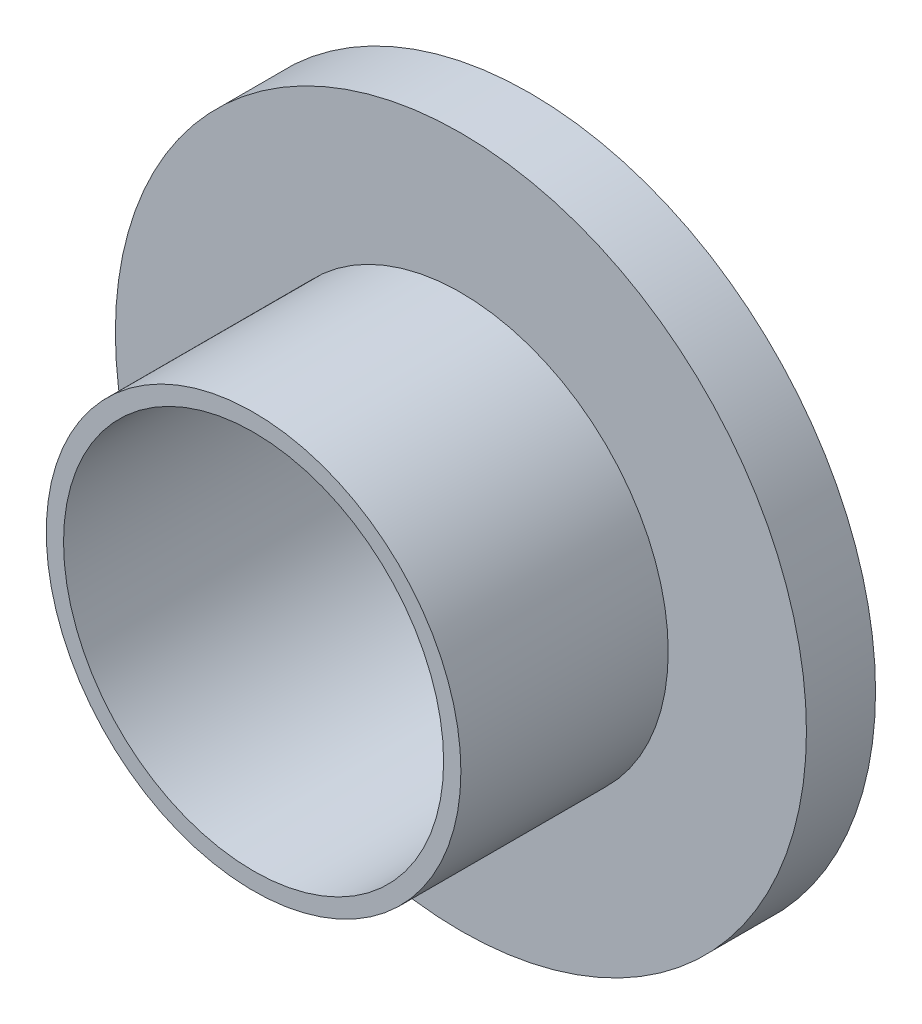
ISO-10303-21;
HEADER;
FILE_DESCRIPTION(('STEP AP214'),'2;1');
FILE_NAME('part.step','',(''),(''),'','','');
FILE_SCHEMA(('AUTOMOTIVE_DESIGN { 1 0 10303 214 1 1 1 1 }'));
ENDSEC;
DATA;
#1=APPLICATION_CONTEXT('core data for automotive mechanical design processes');
#2=APPLICATION_PROTOCOL_DEFINITION('international standard','automotive_design',2000,#1);
#3=PRODUCT_CONTEXT('',#1,'mechanical');
#4=PRODUCT('Part','Part','',(#3));
#5=PRODUCT_RELATED_PRODUCT_CATEGORY('part','',(#4));
#6=PRODUCT_DEFINITION_FORMATION('','',#4);
#7=PRODUCT_DEFINITION_CONTEXT('part definition',#1,'design');
#8=PRODUCT_DEFINITION('design','',#6,#7);
#9=PRODUCT_DEFINITION_SHAPE('','',#8);
#10=(LENGTH_UNIT() NAMED_UNIT(*) SI_UNIT(.MILLI.,.METRE.));
#11=(NAMED_UNIT(*) PLANE_ANGLE_UNIT() SI_UNIT($,.RADIAN.));
#12=(NAMED_UNIT(*) SI_UNIT($,.STERADIAN.) SOLID_ANGLE_UNIT());
#13=UNCERTAINTY_MEASURE_WITH_UNIT(LENGTH_MEASURE(1.E-05),#10,'distance_accuracy_value','');
#14=(GEOMETRIC_REPRESENTATION_CONTEXT(3) GLOBAL_UNCERTAINTY_ASSIGNED_CONTEXT((#13)) GLOBAL_UNIT_ASSIGNED_CONTEXT((#10,
#11,#12)) REPRESENTATION_CONTEXT('',''));
#15=CARTESIAN_POINT('',(0.,0.,0.));
#16=DIRECTION('',(0.,0.,1.));
#17=DIRECTION('',(1.,0.,0.));
#18=AXIS2_PLACEMENT_3D('',#15,#16,#17);
#19=CARTESIAN_POINT('',(0.,0.,16.));
#20=DIRECTION('',(0.,0.,-1.));
#21=DIRECTION('',(-1.,0.,0.));
#22=AXIS2_PLACEMENT_3D('',#19,#20,#21);
#23=CYLINDRICAL_SURFACE('',#22,20.);
#24=CARTESIAN_POINT('',(0.,0.,0.));
#25=DIRECTION('',(0.,0.,1.));
#26=DIRECTION('',(1.,0.,0.));
#27=AXIS2_PLACEMENT_3D('',#24,#25,#26);
#28=CIRCLE('',#27,20.);
#29=CARTESIAN_POINT('',(20.,0.,0.));
#30=VERTEX_POINT('',#29);
#31=EDGE_CURVE('E10',#30,#30,#28,.T.);
#32=ORIENTED_EDGE('',*,*,#31,.T.);
#33=EDGE_LOOP('',(#32));
#34=FACE_BOUND('',#33,.T.);
#35=CARTESIAN_POINT('',(0.,0.,4.));
#36=DIRECTION('',(0.,0.,1.));
#37=DIRECTION('',(1.,0.,0.));
#38=AXIS2_PLACEMENT_3D('',#35,#36,#37);
#39=CIRCLE('',#38,20.);
#40=CARTESIAN_POINT('',(20.,0.,4.));
#41=VERTEX_POINT('',#40);
#42=EDGE_CURVE('E35',#41,#41,#39,.T.);
#43=ORIENTED_EDGE('',*,*,#42,.F.);
#44=EDGE_LOOP('',(#43));
#45=FACE_BOUND('',#44,.T.);
#46=ADVANCED_FACE('F29',(#34,#45),#23,.T.);
#47=CARTESIAN_POINT('',(0.,0.,0.));
#48=DIRECTION('',(0.,0.,1.));
#49=DIRECTION('',(1.,0.,0.));
#50=AXIS2_PLACEMENT_3D('',#47,#48,#49);
#51=PLANE('',#50);
#52=CARTESIAN_POINT('',(0.,0.,0.));
#53=DIRECTION('',(0.,0.,1.));
#54=DIRECTION('',(1.,0.,0.));
#55=AXIS2_PLACEMENT_3D('',#52,#53,#54);
#56=CIRCLE('',#55,11.);
#57=CARTESIAN_POINT('',(11.,0.,0.));
#58=VERTEX_POINT('',#57);
#59=EDGE_CURVE('E47',#58,#58,#56,.T.);
#60=ORIENTED_EDGE('',*,*,#59,.T.);
#61=EDGE_LOOP('',(#60));
#62=FACE_BOUND('',#61,.T.);
#63=ORIENTED_EDGE('',*,*,#31,.F.);
#64=EDGE_LOOP('',(#63));
#65=FACE_BOUND('',#64,.T.);
#66=ADVANCED_FACE('F55',(#62,#65),#51,.F.);
#67=CARTESIAN_POINT('',(0.,0.,4.));
#68=DIRECTION('',(0.,0.,1.));
#69=DIRECTION('',(1.,0.,0.));
#70=AXIS2_PLACEMENT_3D('',#67,#68,#69);
#71=PLANE('',#70);
#72=CARTESIAN_POINT('',(0.,0.,4.));
#73=DIRECTION('',(0.,0.,1.));
#74=DIRECTION('',(1.,0.,0.));
#75=AXIS2_PLACEMENT_3D('',#72,#73,#74);
#76=CIRCLE('',#75,12.);
#77=CARTESIAN_POINT('',(12.,0.,4.));
#78=VERTEX_POINT('',#77);
#79=EDGE_CURVE('E39',#78,#78,#76,.T.);
#80=ORIENTED_EDGE('',*,*,#79,.F.);
#81=EDGE_LOOP('',(#80));
#82=FACE_BOUND('',#81,.T.);
#83=ORIENTED_EDGE('',*,*,#42,.T.);
#84=EDGE_LOOP('',(#83));
#85=FACE_BOUND('',#84,.T.);
#86=ADVANCED_FACE('F72',(#82,#85),#71,.T.);
#87=CARTESIAN_POINT('',(0.,0.,4.));
#88=DIRECTION('',(0.,0.,1.));
#89=DIRECTION('',(1.,0.,0.));
#90=AXIS2_PLACEMENT_3D('',#87,#88,#89);
#91=CYLINDRICAL_SURFACE('',#90,12.);
#92=ORIENTED_EDGE('',*,*,#79,.T.);
#93=EDGE_LOOP('',(#92));
#94=FACE_BOUND('',#93,.T.);
#95=CARTESIAN_POINT('',(0.,0.,16.));
#96=DIRECTION('',(0.,0.,1.));
#97=DIRECTION('',(1.,0.,0.));
#98=AXIS2_PLACEMENT_3D('',#95,#96,#97);
#99=CIRCLE('',#98,12.);
#100=CARTESIAN_POINT('',(12.,0.,16.));
#101=VERTEX_POINT('',#100);
#102=EDGE_CURVE('E43',#101,#101,#99,.T.);
#103=ORIENTED_EDGE('',*,*,#102,.F.);
#104=EDGE_LOOP('',(#103));
#105=FACE_BOUND('',#104,.T.);
#106=ADVANCED_FACE('F67',(#94,#105),#91,.T.);
#107=CARTESIAN_POINT('',(0.,0.,16.));
#108=DIRECTION('',(0.,0.,1.));
#109=DIRECTION('',(1.,0.,0.));
#110=AXIS2_PLACEMENT_3D('',#107,#108,#109);
#111=PLANE('',#110);
#112=CARTESIAN_POINT('',(0.,0.,16.));
#113=DIRECTION('',(0.,0.,1.));
#114=DIRECTION('',(1.,0.,0.));
#115=AXIS2_PLACEMENT_3D('',#112,#113,#114);
#116=CIRCLE('',#115,11.);
#117=CARTESIAN_POINT('',(11.,0.,16.));
#118=VERTEX_POINT('',#117);
#119=EDGE_CURVE('E49',#118,#118,#116,.T.);
#120=ORIENTED_EDGE('',*,*,#119,.F.);
#121=EDGE_LOOP('',(#120));
#122=FACE_BOUND('',#121,.T.);
#123=ORIENTED_EDGE('',*,*,#102,.T.);
#124=EDGE_LOOP('',(#123));
#125=FACE_BOUND('',#124,.T.);
#126=ADVANCED_FACE('F61',(#122,#125),#111,.T.);
#127=CARTESIAN_POINT('',(0.,0.,0.));
#128=DIRECTION('',(0.,0.,1.));
#129=DIRECTION('',(1.,0.,0.));
#130=AXIS2_PLACEMENT_3D('',#127,#128,#129);
#131=CYLINDRICAL_SURFACE('',#130,11.);
#132=ORIENTED_EDGE('',*,*,#59,.F.);
#133=EDGE_LOOP('',(#132));
#134=FACE_BOUND('',#133,.T.);
#135=ORIENTED_EDGE('',*,*,#119,.T.);
#136=EDGE_LOOP('',(#135));
#137=FACE_BOUND('',#136,.T.);
#138=ADVANCED_FACE('F58',(#134,#137),#131,.F.);
#139=CLOSED_SHELL('',(#46,#66,#86,#106,#126,#138));
#140=MANIFOLD_SOLID_BREP('B2',#139);
#141=ADVANCED_BREP_SHAPE_REPRESENTATION('',(#18,#140),#14);
#142=SHAPE_DEFINITION_REPRESENTATION(#9,#141);
ENDSEC;
END-ISO-10303-21;
